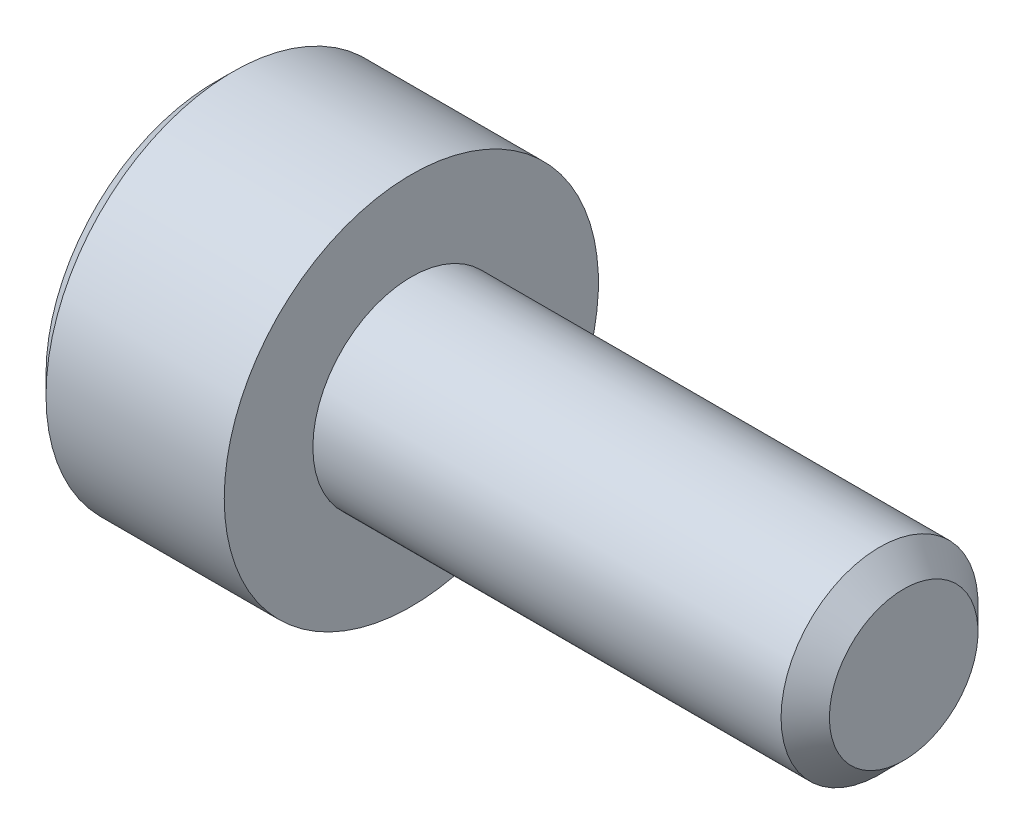
ISO-10303-21;
HEADER;
FILE_DESCRIPTION(('STEP AP214'),'2;1');
FILE_NAME('part.step','',(''),(''),'','','');
FILE_SCHEMA(('AUTOMOTIVE_DESIGN { 1 0 10303 214 1 1 1 1 }'));
ENDSEC;
DATA;
#1=APPLICATION_CONTEXT('core data for automotive mechanical design processes');
#2=APPLICATION_PROTOCOL_DEFINITION('international standard','automotive_design',2000,#1);
#3=PRODUCT_CONTEXT('',#1,'mechanical');
#4=PRODUCT('Part','Part','',(#3));
#5=PRODUCT_RELATED_PRODUCT_CATEGORY('part','',(#4));
#6=PRODUCT_DEFINITION_FORMATION('','',#4);
#7=PRODUCT_DEFINITION_CONTEXT('part definition',#1,'design');
#8=PRODUCT_DEFINITION('design','',#6,#7);
#9=PRODUCT_DEFINITION_SHAPE('','',#8);
#10=(LENGTH_UNIT() NAMED_UNIT(*) SI_UNIT(.MILLI.,.METRE.));
#11=(NAMED_UNIT(*) PLANE_ANGLE_UNIT() SI_UNIT($,.RADIAN.));
#12=(NAMED_UNIT(*) SI_UNIT($,.STERADIAN.) SOLID_ANGLE_UNIT());
#13=UNCERTAINTY_MEASURE_WITH_UNIT(LENGTH_MEASURE(1.E-05),#10,'distance_accuracy_value','');
#14=(GEOMETRIC_REPRESENTATION_CONTEXT(3) GLOBAL_UNCERTAINTY_ASSIGNED_CONTEXT((#13)) GLOBAL_UNIT_ASSIGNED_CONTEXT((#10,
#11,#12)) REPRESENTATION_CONTEXT('',''));
#15=CARTESIAN_POINT('',(0.,0.,0.));
#16=DIRECTION('',(0.,0.,1.));
#17=DIRECTION('',(1.,0.,0.));
#18=AXIS2_PLACEMENT_3D('',#15,#16,#17);
#19=CARTESIAN_POINT('',(-2.,0.,0.));
#20=DIRECTION('',(1.,0.,0.));
#21=DIRECTION('',(0.,0.,-1.));
#22=AXIS2_PLACEMENT_3D('',#19,#20,#21);
#23=PLANE('',#22);
#24=CARTESIAN_POINT('',(-2.,0.,0.));
#25=DIRECTION('',(-1.,0.,0.));
#26=DIRECTION('',(0.,0.,1.));
#27=AXIS2_PLACEMENT_3D('',#24,#25,#26);
#28=CIRCLE('',#27,1.71);
#29=CARTESIAN_POINT('',(-2.,0.,1.71));
#30=VERTEX_POINT('',#29);
#31=EDGE_CURVE('E11',#30,#30,#28,.T.);
#32=ORIENTED_EDGE('',*,*,#31,.T.);
#33=EDGE_LOOP('',(#32));
#34=FACE_BOUND('',#33,.T.);
#35=DIRECTION('',(0.,-1.,0.));
#36=VECTOR('',#35,1.);
#37=CARTESIAN_POINT('',(-2.,0.43301270189222,0.75));
#38=LINE('',#37,#36);
#39=CARTESIAN_POINT('',(-2.,0.43301270189222,0.75));
#40=VERTEX_POINT('',#39);
#41=CARTESIAN_POINT('',(-2.,-0.43301270189222,0.75));
#42=VERTEX_POINT('',#41);
#43=EDGE_CURVE('E53',#40,#42,#38,.T.);
#44=ORIENTED_EDGE('',*,*,#43,.T.);
#45=DIRECTION('',(0.,-0.500000000000001,-0.866025403784438));
#46=VECTOR('',#45,1.);
#47=CARTESIAN_POINT('',(-2.,-0.43301270189222,0.75));
#48=LINE('',#47,#46);
#49=CARTESIAN_POINT('',(-2.,-0.86602540378444,0.));
#50=VERTEX_POINT('',#49);
#51=EDGE_CURVE('E124',#42,#50,#48,.T.);
#52=ORIENTED_EDGE('',*,*,#51,.T.);
#53=DIRECTION('',(0.,0.500000000000001,-0.866025403784438));
#54=VECTOR('',#53,1.);
#55=CARTESIAN_POINT('',(-2.,-0.86602540378444,0.));
#56=LINE('',#55,#54);
#57=CARTESIAN_POINT('',(-2.,-0.43301270189222,-0.75));
#58=VERTEX_POINT('',#57);
#59=EDGE_CURVE('E127',#50,#58,#56,.T.);
#60=ORIENTED_EDGE('',*,*,#59,.T.);
#61=DIRECTION('',(0.,1.,0.));
#62=VECTOR('',#61,1.);
#63=CARTESIAN_POINT('',(-2.,-0.43301270189222,-0.75));
#64=LINE('',#63,#62);
#65=CARTESIAN_POINT('',(-2.,0.43301270189222,-0.75));
#66=VERTEX_POINT('',#65);
#67=EDGE_CURVE('E130',#58,#66,#64,.T.);
#68=ORIENTED_EDGE('',*,*,#67,.T.);
#69=DIRECTION('',(0.,0.500000000000001,0.866025403784438));
#70=VECTOR('',#69,1.);
#71=CARTESIAN_POINT('',(-2.,0.43301270189222,-0.75));
#72=LINE('',#71,#70);
#73=CARTESIAN_POINT('',(-2.,0.86602540378444,0.));
#74=VERTEX_POINT('',#73);
#75=EDGE_CURVE('E114',#66,#74,#72,.T.);
#76=ORIENTED_EDGE('',*,*,#75,.T.);
#77=DIRECTION('',(0.,-0.500000000000001,0.866025403784438));
#78=VECTOR('',#77,1.);
#79=CARTESIAN_POINT('',(-2.,0.86602540378444,0.));
#80=LINE('',#79,#78);
#81=EDGE_CURVE('E133',#74,#40,#80,.T.);
#82=ORIENTED_EDGE('',*,*,#81,.T.);
#83=EDGE_LOOP('',(#44,#52,#60,#68,#76,#82));
#84=FACE_BOUND('',#83,.T.);
#85=ADVANCED_FACE('F39',(#34,#84),#23,.F.);
#86=CARTESIAN_POINT('',(-1.81,0.,0.));
#87=DIRECTION('',(1.,0.,0.));
#88=DIRECTION('',(0.,0.,-1.));
#89=AXIS2_PLACEMENT_3D('',#86,#87,#88);
#90=CONICAL_SURFACE('',#89,1.9,0.785398163397448);
#91=ORIENTED_EDGE('',*,*,#31,.F.);
#92=EDGE_LOOP('',(#91));
#93=FACE_BOUND('',#92,.T.);
#94=CARTESIAN_POINT('',(-1.81,0.,0.));
#95=DIRECTION('',(-1.,0.,0.));
#96=DIRECTION('',(0.,0.,1.));
#97=AXIS2_PLACEMENT_3D('',#94,#95,#96);
#98=CIRCLE('',#97,1.9);
#99=CARTESIAN_POINT('',(-1.81,0.,1.9));
#100=VERTEX_POINT('',#99);
#101=EDGE_CURVE('E46',#100,#100,#98,.T.);
#102=ORIENTED_EDGE('',*,*,#101,.T.);
#103=EDGE_LOOP('',(#102));
#104=FACE_BOUND('',#103,.T.);
#105=ADVANCED_FACE('F158',(#93,#104),#90,.T.);
#106=CARTESIAN_POINT('',(5.,0.,0.));
#107=DIRECTION('',(-1.,0.,0.));
#108=DIRECTION('',(0.,0.,1.));
#109=AXIS2_PLACEMENT_3D('',#106,#107,#108);
#110=CYLINDRICAL_SURFACE('',#109,1.9);
#111=ORIENTED_EDGE('',*,*,#101,.F.);
#112=EDGE_LOOP('',(#111));
#113=FACE_BOUND('',#112,.T.);
#114=CARTESIAN_POINT('',(0.,0.,0.));
#115=DIRECTION('',(-1.,0.,0.));
#116=DIRECTION('',(0.,0.,1.));
#117=AXIS2_PLACEMENT_3D('',#114,#115,#116);
#118=CIRCLE('',#117,1.9);
#119=CARTESIAN_POINT('',(0.,0.,1.9));
#120=VERTEX_POINT('',#119);
#121=EDGE_CURVE('E153',#120,#120,#118,.T.);
#122=ORIENTED_EDGE('',*,*,#121,.T.);
#123=EDGE_LOOP('',(#122));
#124=FACE_BOUND('',#123,.T.);
#125=ADVANCED_FACE('F160',(#113,#124),#110,.T.);
#126=CARTESIAN_POINT('',(0.,1.9,0.));
#127=DIRECTION('',(-1.,0.,0.));
#128=DIRECTION('',(0.,0.,1.));
#129=AXIS2_PLACEMENT_3D('',#126,#127,#128);
#130=PLANE('',#129);
#131=ORIENTED_EDGE('',*,*,#121,.F.);
#132=EDGE_LOOP('',(#131));
#133=FACE_BOUND('',#132,.T.);
#134=CARTESIAN_POINT('',(0.,0.,0.));
#135=DIRECTION('',(-1.,0.,0.));
#136=DIRECTION('',(0.,0.,1.));
#137=AXIS2_PLACEMENT_3D('',#134,#135,#136);
#138=CIRCLE('',#137,1.);
#139=CARTESIAN_POINT('',(0.,0.,1.));
#140=VERTEX_POINT('',#139);
#141=EDGE_CURVE('E150',#140,#140,#138,.T.);
#142=ORIENTED_EDGE('',*,*,#141,.T.);
#143=EDGE_LOOP('',(#142));
#144=FACE_BOUND('',#143,.T.);
#145=ADVANCED_FACE('F163',(#133,#144),#130,.F.);
#146=CARTESIAN_POINT('',(5.,0.,0.));
#147=DIRECTION('',(-1.,0.,0.));
#148=DIRECTION('',(0.,0.,1.));
#149=AXIS2_PLACEMENT_3D('',#146,#147,#148);
#150=CYLINDRICAL_SURFACE('',#149,1.);
#151=ORIENTED_EDGE('',*,*,#141,.F.);
#152=EDGE_LOOP('',(#151));
#153=FACE_BOUND('',#152,.T.);
#154=CARTESIAN_POINT('',(4.7545,0.,0.));
#155=DIRECTION('',(-1.,0.,0.));
#156=DIRECTION('',(0.,0.,1.));
#157=AXIS2_PLACEMENT_3D('',#154,#155,#156);
#158=CIRCLE('',#157,1.);
#159=CARTESIAN_POINT('',(4.7545,0.,1.));
#160=VERTEX_POINT('',#159);
#161=EDGE_CURVE('E147',#160,#160,#158,.T.);
#162=ORIENTED_EDGE('',*,*,#161,.T.);
#163=EDGE_LOOP('',(#162));
#164=FACE_BOUND('',#163,.T.);
#165=ADVANCED_FACE('F169',(#153,#164),#150,.T.);
#166=CARTESIAN_POINT('',(5.,0.,0.));
#167=DIRECTION('',(-1.,0.,0.));
#168=DIRECTION('',(0.,0.,1.));
#169=AXIS2_PLACEMENT_3D('',#166,#167,#168);
#170=CONICAL_SURFACE('',#169,0.7545,0.785398163397448);
#171=ORIENTED_EDGE('',*,*,#161,.F.);
#172=EDGE_LOOP('',(#171));
#173=FACE_BOUND('',#172,.T.);
#174=CARTESIAN_POINT('',(5.,0.,0.));
#175=DIRECTION('',(-1.,0.,0.));
#176=DIRECTION('',(0.,0.,1.));
#177=AXIS2_PLACEMENT_3D('',#174,#175,#176);
#178=CIRCLE('',#177,0.7545);
#179=CARTESIAN_POINT('',(5.,0.,0.7545));
#180=VERTEX_POINT('',#179);
#181=EDGE_CURVE('E144',#180,#180,#178,.T.);
#182=ORIENTED_EDGE('',*,*,#181,.T.);
#183=EDGE_LOOP('',(#182));
#184=FACE_BOUND('',#183,.T.);
#185=ADVANCED_FACE('F175',(#173,#184),#170,.T.);
#186=CARTESIAN_POINT('',(5.,0.7545,0.));
#187=DIRECTION('',(-1.,0.,0.));
#188=DIRECTION('',(0.,0.,1.));
#189=AXIS2_PLACEMENT_3D('',#186,#187,#188);
#190=PLANE('',#189);
#191=ORIENTED_EDGE('',*,*,#181,.F.);
#192=EDGE_LOOP('',(#191));
#193=FACE_BOUND('',#192,.T.);
#194=ADVANCED_FACE('F181',(#193),#190,.F.);
#195=CARTESIAN_POINT('',(-1.2,0.43301270189222,0.75));
#196=DIRECTION('',(0.,0.,-1.));
#197=DIRECTION('',(-1.,0.,0.));
#198=AXIS2_PLACEMENT_3D('',#195,#196,#197);
#199=PLANE('',#198);
#200=ORIENTED_EDGE('',*,*,#43,.F.);
#201=DIRECTION('',(-1.,0.,0.));
#202=VECTOR('',#201,1.);
#203=CARTESIAN_POINT('',(-1.2,0.43301270189222,0.75));
#204=LINE('',#203,#202);
#205=CARTESIAN_POINT('',(-1.2,0.43301270189222,0.75));
#206=VERTEX_POINT('',#205);
#207=EDGE_CURVE('E119',#206,#40,#204,.T.);
#208=ORIENTED_EDGE('',*,*,#207,.F.);
#209=DIRECTION('',(0.,-1.,0.));
#210=VECTOR('',#209,1.);
#211=CARTESIAN_POINT('',(-1.2,0.43301270189222,0.75));
#212=LINE('',#211,#210);
#213=CARTESIAN_POINT('',(-1.2,-0.43301270189222,0.75));
#214=VERTEX_POINT('',#213);
#215=EDGE_CURVE('E136',#206,#214,#212,.T.);
#216=ORIENTED_EDGE('',*,*,#215,.T.);
#217=DIRECTION('',(-1.,0.,0.));
#218=VECTOR('',#217,1.);
#219=CARTESIAN_POINT('',(-1.2,-0.43301270189222,0.75));
#220=LINE('',#219,#218);
#221=EDGE_CURVE('E142',#214,#42,#220,.T.);
#222=ORIENTED_EDGE('',*,*,#221,.T.);
#223=EDGE_LOOP('',(#200,#208,#216,#222));
#224=FACE_BOUND('',#223,.T.);
#225=ADVANCED_FACE('F186',(#224),#199,.T.);
#226=CARTESIAN_POINT('',(-1.2,-0.43301270189222,0.75));
#227=DIRECTION('',(0.,0.866025403784438,-0.500000000000001));
#228=DIRECTION('',(0.,0.500000000000001,0.866025403784438));
#229=AXIS2_PLACEMENT_3D('',#226,#227,#228);
#230=PLANE('',#229);
#231=ORIENTED_EDGE('',*,*,#51,.F.);
#232=ORIENTED_EDGE('',*,*,#221,.F.);
#233=DIRECTION('',(0.,-0.500000000000001,-0.866025403784438));
#234=VECTOR('',#233,1.);
#235=CARTESIAN_POINT('',(-1.2,-0.43301270189222,0.75));
#236=LINE('',#235,#234);
#237=CARTESIAN_POINT('',(-1.2,-0.86602540378444,0.));
#238=VERTEX_POINT('',#237);
#239=EDGE_CURVE('E92',#214,#238,#236,.T.);
#240=ORIENTED_EDGE('',*,*,#239,.T.);
#241=DIRECTION('',(-1.,0.,0.));
#242=VECTOR('',#241,1.);
#243=CARTESIAN_POINT('',(-1.2,-0.86602540378444,0.));
#244=LINE('',#243,#242);
#245=EDGE_CURVE('E140',#238,#50,#244,.T.);
#246=ORIENTED_EDGE('',*,*,#245,.T.);
#247=EDGE_LOOP('',(#231,#232,#240,#246));
#248=FACE_BOUND('',#247,.T.);
#249=ADVANCED_FACE('F191',(#248),#230,.T.);
#250=CARTESIAN_POINT('',(-1.2,-0.86602540378444,0.));
#251=DIRECTION('',(0.,0.866025403784438,0.500000000000001));
#252=DIRECTION('',(0.,-0.500000000000001,0.866025403784438));
#253=AXIS2_PLACEMENT_3D('',#250,#251,#252);
#254=PLANE('',#253);
#255=ORIENTED_EDGE('',*,*,#59,.F.);
#256=ORIENTED_EDGE('',*,*,#245,.F.);
#257=DIRECTION('',(0.,0.500000000000001,-0.866025403784438));
#258=VECTOR('',#257,1.);
#259=CARTESIAN_POINT('',(-1.2,-0.86602540378444,0.));
#260=LINE('',#259,#258);
#261=CARTESIAN_POINT('',(-1.2,-0.43301270189222,-0.75));
#262=VERTEX_POINT('',#261);
#263=EDGE_CURVE('E110',#238,#262,#260,.T.);
#264=ORIENTED_EDGE('',*,*,#263,.T.);
#265=DIRECTION('',(-1.,0.,0.));
#266=VECTOR('',#265,1.);
#267=CARTESIAN_POINT('',(-1.2,-0.43301270189222,-0.75));
#268=LINE('',#267,#266);
#269=EDGE_CURVE('E107',#262,#58,#268,.T.);
#270=ORIENTED_EDGE('',*,*,#269,.T.);
#271=EDGE_LOOP('',(#255,#256,#264,#270));
#272=FACE_BOUND('',#271,.T.);
#273=ADVANCED_FACE('F208',(#272),#254,.T.);
#274=CARTESIAN_POINT('',(-1.2,-0.43301270189222,-0.75));
#275=DIRECTION('',(0.,0.,1.));
#276=DIRECTION('',(1.,0.,0.));
#277=AXIS2_PLACEMENT_3D('',#274,#275,#276);
#278=PLANE('',#277);
#279=ORIENTED_EDGE('',*,*,#67,.F.);
#280=ORIENTED_EDGE('',*,*,#269,.F.);
#281=DIRECTION('',(0.,1.,0.));
#282=VECTOR('',#281,1.);
#283=CARTESIAN_POINT('',(-1.2,-0.43301270189222,-0.75));
#284=LINE('',#283,#282);
#285=CARTESIAN_POINT('',(-1.2,0.43301270189222,-0.75));
#286=VERTEX_POINT('',#285);
#287=EDGE_CURVE('E102',#262,#286,#284,.T.);
#288=ORIENTED_EDGE('',*,*,#287,.T.);
#289=DIRECTION('',(-1.,0.,0.));
#290=VECTOR('',#289,1.);
#291=CARTESIAN_POINT('',(-1.2,0.43301270189222,-0.75));
#292=LINE('',#291,#290);
#293=EDGE_CURVE('E106',#286,#66,#292,.T.);
#294=ORIENTED_EDGE('',*,*,#293,.T.);
#295=EDGE_LOOP('',(#279,#280,#288,#294));
#296=FACE_BOUND('',#295,.T.);
#297=ADVANCED_FACE('F105',(#296),#278,.T.);
#298=CARTESIAN_POINT('',(-1.2,0.43301270189222,-0.75));
#299=DIRECTION('',(0.,-0.866025403784438,0.500000000000001));
#300=DIRECTION('',(0.,-0.500000000000001,-0.866025403784438));
#301=AXIS2_PLACEMENT_3D('',#298,#299,#300);
#302=PLANE('',#301);
#303=ORIENTED_EDGE('',*,*,#75,.F.);
#304=ORIENTED_EDGE('',*,*,#293,.F.);
#305=DIRECTION('',(0.,0.500000000000001,0.866025403784438));
#306=VECTOR('',#305,1.);
#307=CARTESIAN_POINT('',(-1.2,0.43301270189222,-0.75));
#308=LINE('',#307,#306);
#309=CARTESIAN_POINT('',(-1.2,0.86602540378444,0.));
#310=VERTEX_POINT('',#309);
#311=EDGE_CURVE('E109',#286,#310,#308,.T.);
#312=ORIENTED_EDGE('',*,*,#311,.T.);
#313=DIRECTION('',(-1.,0.,0.));
#314=VECTOR('',#313,1.);
#315=CARTESIAN_POINT('',(-1.2,0.86602540378444,0.));
#316=LINE('',#315,#314);
#317=EDGE_CURVE('E83',#310,#74,#316,.T.);
#318=ORIENTED_EDGE('',*,*,#317,.T.);
#319=EDGE_LOOP('',(#303,#304,#312,#318));
#320=FACE_BOUND('',#319,.T.);
#321=ADVANCED_FACE('F112',(#320),#302,.T.);
#322=CARTESIAN_POINT('',(-1.2,0.86602540378444,0.));
#323=DIRECTION('',(0.,-0.866025403784438,-0.500000000000001));
#324=DIRECTION('',(0.,0.500000000000001,-0.866025403784438));
#325=AXIS2_PLACEMENT_3D('',#322,#323,#324);
#326=PLANE('',#325);
#327=ORIENTED_EDGE('',*,*,#81,.F.);
#328=ORIENTED_EDGE('',*,*,#317,.F.);
#329=DIRECTION('',(0.,-0.500000000000001,0.866025403784438));
#330=VECTOR('',#329,1.);
#331=CARTESIAN_POINT('',(-1.2,0.86602540378444,0.));
#332=LINE('',#331,#330);
#333=EDGE_CURVE('E61',#310,#206,#332,.T.);
#334=ORIENTED_EDGE('',*,*,#333,.T.);
#335=ORIENTED_EDGE('',*,*,#207,.T.);
#336=EDGE_LOOP('',(#327,#328,#334,#335));
#337=FACE_BOUND('',#336,.T.);
#338=ADVANCED_FACE('F201',(#337),#326,.T.);
#339=CARTESIAN_POINT('',(-1.2,0.,0.));
#340=DIRECTION('',(1.,0.,0.));
#341=DIRECTION('',(0.,0.,-1.));
#342=AXIS2_PLACEMENT_3D('',#339,#340,#341);
#343=PLANE('',#342);
#344=ORIENTED_EDGE('',*,*,#215,.F.);
#345=ORIENTED_EDGE('',*,*,#333,.F.);
#346=ORIENTED_EDGE('',*,*,#311,.F.);
#347=ORIENTED_EDGE('',*,*,#287,.F.);
#348=ORIENTED_EDGE('',*,*,#263,.F.);
#349=ORIENTED_EDGE('',*,*,#239,.F.);
#350=EDGE_LOOP('',(#344,#345,#346,#347,#348,#349));
#351=FACE_BOUND('',#350,.T.);
#352=ADVANCED_FACE('F117',(#351),#343,.F.);
#353=CLOSED_SHELL('',(#85,#105,#125,#145,#165,#185,#194,#225,#249,#273,#297,#321,#338,#352));
#354=MANIFOLD_SOLID_BREP('B2',#353);
#355=ADVANCED_BREP_SHAPE_REPRESENTATION('',(#18,#354),#14);
#356=SHAPE_DEFINITION_REPRESENTATION(#9,#355);
ENDSEC;
END-ISO-10303-21;
